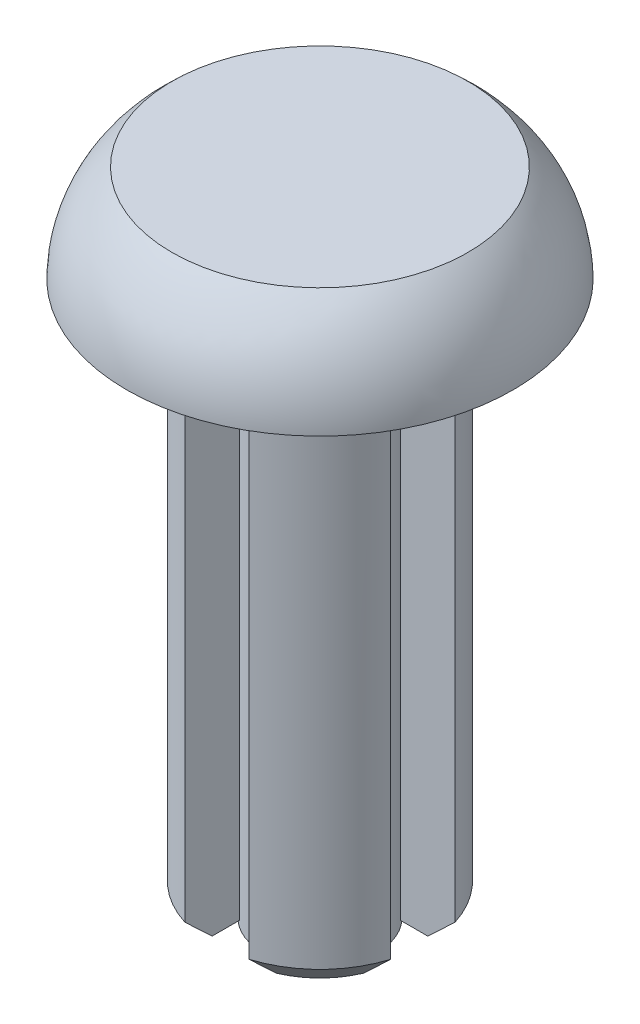
ISO-10303-21;
HEADER;
FILE_DESCRIPTION(('STEP AP214'),'2;1');
FILE_NAME('part.step','',(''),(''),'','','');
FILE_SCHEMA(('AUTOMOTIVE_DESIGN { 1 0 10303 214 1 1 1 1 }'));
ENDSEC;
DATA;
#1=APPLICATION_CONTEXT('core data for automotive mechanical design processes');
#2=APPLICATION_PROTOCOL_DEFINITION('international standard','automotive_design',2000,#1);
#3=PRODUCT_CONTEXT('',#1,'mechanical');
#4=PRODUCT('Part','Part','',(#3));
#5=PRODUCT_RELATED_PRODUCT_CATEGORY('part','',(#4));
#6=PRODUCT_DEFINITION_FORMATION('','',#4);
#7=PRODUCT_DEFINITION_CONTEXT('part definition',#1,'design');
#8=PRODUCT_DEFINITION('design','',#6,#7);
#9=PRODUCT_DEFINITION_SHAPE('','',#8);
#10=(LENGTH_UNIT() NAMED_UNIT(*) SI_UNIT(.MILLI.,.METRE.));
#11=(NAMED_UNIT(*) PLANE_ANGLE_UNIT() SI_UNIT($,.RADIAN.));
#12=(NAMED_UNIT(*) SI_UNIT($,.STERADIAN.) SOLID_ANGLE_UNIT());
#13=UNCERTAINTY_MEASURE_WITH_UNIT(LENGTH_MEASURE(1.E-05),#10,'distance_accuracy_value','');
#14=(GEOMETRIC_REPRESENTATION_CONTEXT(3) GLOBAL_UNCERTAINTY_ASSIGNED_CONTEXT((#13)) GLOBAL_UNIT_ASSIGNED_CONTEXT((#10,
#11,#12)) REPRESENTATION_CONTEXT('',''));
#15=CARTESIAN_POINT('',(0.,0.,0.));
#16=DIRECTION('',(0.,0.,1.));
#17=DIRECTION('',(1.,0.,0.));
#18=AXIS2_PLACEMENT_3D('',#15,#16,#17);
#19=CARTESIAN_POINT('',(0.,1.905,0.));
#20=DIRECTION('',(0.,1.,0.));
#21=DIRECTION('',(0.,0.,1.));
#22=AXIS2_PLACEMENT_3D('',#19,#20,#21);
#23=PLANE('',#22);
#24=CARTESIAN_POINT('',(0.,1.905,0.));
#25=DIRECTION('',(0.,1.,0.));
#26=DIRECTION('',(0.,0.,1.));
#27=AXIS2_PLACEMENT_3D('',#24,#25,#26);
#28=CIRCLE('',#27,2.921);
#29=CARTESIAN_POINT('',(0.,1.905,2.921));
#30=VERTEX_POINT('',#29);
#31=EDGE_CURVE('E20',#30,#30,#28,.F.);
#32=ORIENTED_EDGE('',*,*,#31,.F.);
#33=EDGE_LOOP('',(#32));
#34=FACE_BOUND('',#33,.T.);
#35=ADVANCED_FACE('F17',(#34),#23,.T.);
#36=CARTESIAN_POINT('',(0.,-11.4394,0.));
#37=DIRECTION('',(0.,-1.,0.));
#38=DIRECTION('',(0.,0.,-1.));
#39=AXIS2_PLACEMENT_3D('',#36,#37,#38);
#40=PLANE('',#39);
#41=CARTESIAN_POINT('',(0.,-11.4393999999152,0.));
#42=DIRECTION('',(0.,1.,0.));
#43=DIRECTION('',(0.,0.,1.));
#44=AXIS2_PLACEMENT_3D('',#41,#42,#43);
#45=CIRCLE('',#44,0.634999999988395);
#46=CARTESIAN_POINT('',(0.,-11.4393999999152,0.634999999988395));
#47=VERTEX_POINT('',#46);
#48=EDGE_CURVE('E164',#47,#47,#45,.T.);
#49=ORIENTED_EDGE('',*,*,#48,.F.);
#50=EDGE_LOOP('',(#49));
#51=FACE_BOUND('',#50,.T.);
#52=ADVANCED_FACE('F206',(#51),#40,.T.);
#53=CARTESIAN_POINT('',(0.,-0.0595861521909685,1.19674395959077));
#54=DIRECTION('',(1.,0.,0.));
#55=DIRECTION('',(0.,0.,1.));
#56=AXIS2_PLACEMENT_3D('',#53,#54,#55);
#57=CIRCLE('',#56,2.61393527889813);
#58=TRIMMED_CURVE('',#57,(PARAMETER_VALUE(-2.04635172054682)),
(PARAMETER_VALUE(2.04635172054682)),.T.,.PARAMETER.);
#59=CARTESIAN_POINT('',(0.,-0.0595861521909685,0.));
#60=DIRECTION('',(0.,1.,0.));
#61=AXIS1_PLACEMENT('',#59,#60);
#62=SURFACE_OF_REVOLUTION('',#58,#61);
#63=ORIENTED_EDGE('',*,*,#31,.T.);
#64=EDGE_LOOP('',(#63));
#65=FACE_BOUND('',#64,.T.);
#66=CARTESIAN_POINT('',(0.,0.,0.));
#67=DIRECTION('',(0.,1.,0.));
#68=DIRECTION('',(0.,0.,1.));
#69=AXIS2_PLACEMENT_3D('',#66,#67,#68);
#70=CIRCLE('',#69,3.80999999998721);
#71=CARTESIAN_POINT('',(0.,0.,3.80999999998721));
#72=VERTEX_POINT('',#71);
#73=EDGE_CURVE('E196',#72,#72,#70,.F.);
#74=ORIENTED_EDGE('',*,*,#73,.F.);
#75=EDGE_LOOP('',(#74));
#76=FACE_BOUND('',#75,.T.);
#77=ADVANCED_FACE('F202',(#65,#76),#62,.F.);
#78=CARTESIAN_POINT('',(0.,-10.8044,0.));
#79=DIRECTION('',(0.,-1.,0.));
#80=DIRECTION('',(0.,0.,-1.));
#81=AXIS2_PLACEMENT_3D('',#78,#79,#80);
#82=PLANE('',#81);
#83=DIRECTION('',(0.,0.,-1.));
#84=VECTOR('',#83,1.);
#85=CARTESIAN_POINT('',(0.635000000000001,-10.8044,2.03026292940102));
#86=LINE('',#85,#84);
#87=CARTESIAN_POINT('',(0.635000000000001,-10.8043999999918,1.48954542139407));
#88=VERTEX_POINT('',#87);
#89=CARTESIAN_POINT('',(0.635,-10.8044,0.950380976240581));
#90=VERTEX_POINT('',#89);
#91=EDGE_CURVE('E359',#88,#90,#86,.T.);
#92=ORIENTED_EDGE('',*,*,#91,.T.);
#93=CARTESIAN_POINT('',(0.,-10.8044,0.));
#94=DIRECTION('',(0.,1.,0.));
#95=DIRECTION('',(0.,0.,1.));
#96=AXIS2_PLACEMENT_3D('',#93,#94,#95);
#97=CIRCLE('',#96,1.143);
#98=CARTESIAN_POINT('',(0.950380976240581,-10.8044,0.635));
#99=VERTEX_POINT('',#98);
#100=EDGE_CURVE('E163',#99,#90,#97,.F.);
#101=ORIENTED_EDGE('',*,*,#100,.F.);
#102=DIRECTION('',(1.,0.,0.));
#103=VECTOR('',#102,1.);
#104=CARTESIAN_POINT('',(0.635,-10.8044,0.635));
#105=LINE('',#104,#103);
#106=CARTESIAN_POINT('',(1.48954542139407,-10.8043999999918,0.635));
#107=VERTEX_POINT('',#106);
#108=EDGE_CURVE('E190',#99,#107,#105,.T.);
#109=ORIENTED_EDGE('',*,*,#108,.T.);
#110=CARTESIAN_POINT('',(0.,-10.8043999999836,0.));
#111=DIRECTION('',(0.,1.,0.));
#112=DIRECTION('',(0.,0.,1.));
#113=AXIS2_PLACEMENT_3D('',#110,#111,#112);
#114=CIRCLE('',#113,1.61924999997609);
#115=EDGE_CURVE('E191',#88,#107,#114,.T.);
#116=ORIENTED_EDGE('',*,*,#115,.F.);
#117=EDGE_LOOP('',(#92,#101,#109,#116));
#118=FACE_BOUND('',#117,.T.);
#119=ADVANCED_FACE('F205',(#118),#82,.T.);
#120=CARTESIAN_POINT('',(0.,-10.8044,0.));
#121=DIRECTION('',(0.,-1.,0.));
#122=DIRECTION('',(0.,0.,-1.));
#123=AXIS2_PLACEMENT_3D('',#120,#121,#122);
#124=PLANE('',#123);
#125=DIRECTION('',(-1.,0.,0.));
#126=VECTOR('',#125,1.);
#127=CARTESIAN_POINT('',(0.635,-10.8044,-0.635));
#128=LINE('',#127,#126);
#129=CARTESIAN_POINT('',(1.48954542133228,-10.8043999999918,-0.635));
#130=VERTEX_POINT('',#129);
#131=CARTESIAN_POINT('',(0.950380976240581,-10.8044,-0.635));
#132=VERTEX_POINT('',#131);
#133=EDGE_CURVE('E167',#130,#132,#128,.T.);
#134=ORIENTED_EDGE('',*,*,#133,.T.);
#135=CARTESIAN_POINT('',(0.,-10.8044,0.));
#136=DIRECTION('',(0.,1.,0.));
#137=DIRECTION('',(0.,0.,1.));
#138=AXIS2_PLACEMENT_3D('',#135,#136,#137);
#139=CIRCLE('',#138,1.143);
#140=CARTESIAN_POINT('',(0.635,-10.8044,-0.950380976240581));
#141=VERTEX_POINT('',#140);
#142=EDGE_CURVE('E151',#141,#132,#139,.F.);
#143=ORIENTED_EDGE('',*,*,#142,.F.);
#144=DIRECTION('',(0.,0.,-1.));
#145=VECTOR('',#144,1.);
#146=CARTESIAN_POINT('',(0.635,-10.8044,-0.635));
#147=LINE('',#146,#145);
#148=CARTESIAN_POINT('',(0.635000000000001,-10.8043999999918,-1.48954542133228));
#149=VERTEX_POINT('',#148);
#150=EDGE_CURVE('E338',#141,#149,#147,.T.);
#151=ORIENTED_EDGE('',*,*,#150,.T.);
#152=CARTESIAN_POINT('',(0.,-10.8043999999836,0.));
#153=DIRECTION('',(0.,1.,0.));
#154=DIRECTION('',(0.,0.,1.));
#155=AXIS2_PLACEMENT_3D('',#152,#153,#154);
#156=CIRCLE('',#155,1.61924999991925);
#157=EDGE_CURVE('E170',#130,#149,#156,.T.);
#158=ORIENTED_EDGE('',*,*,#157,.F.);
#159=EDGE_LOOP('',(#134,#143,#151,#158));
#160=FACE_BOUND('',#159,.T.);
#161=ADVANCED_FACE('F168',(#160),#124,.T.);
#162=CARTESIAN_POINT('',(0.,-10.9313999999472,0.));
#163=DIRECTION('',(0.,1.,0.));
#164=DIRECTION('',(0.,0.,1.));
#165=AXIS2_PLACEMENT_3D('',#162,#163,#164);
#166=CONICAL_SURFACE('',#165,1.14299999995637,0.785398163397448);
#167=ORIENTED_EDGE('',*,*,#48,.T.);
#168=EDGE_LOOP('',(#167));
#169=FACE_BOUND('',#168,.T.);
#170=CARTESIAN_POINT('',(0.,-10.9314,0.));
#171=DIRECTION('',(0.,1.,0.));
#172=DIRECTION('',(0.,0.,1.));
#173=AXIS2_PLACEMENT_3D('',#170,#171,#172);
#174=CIRCLE('',#173,1.143);
#175=CARTESIAN_POINT('',(0.,-10.9314,1.143));
#176=VERTEX_POINT('',#175);
#177=EDGE_CURVE('E367',#176,#176,#174,.T.);
#178=ORIENTED_EDGE('',*,*,#177,.F.);
#179=EDGE_LOOP('',(#178));
#180=FACE_BOUND('',#179,.T.);
#181=ADVANCED_FACE('F434',(#169,#180),#166,.T.);
#182=CARTESIAN_POINT('',(0.,0.,0.));
#183=DIRECTION('',(0.,1.,0.));
#184=DIRECTION('',(0.,0.,1.));
#185=AXIS2_PLACEMENT_3D('',#182,#183,#184);
#186=CONICAL_SURFACE('',#185,3.80999999993037,1.54799877919605);
#187=ORIENTED_EDGE('',*,*,#73,.T.);
#188=EDGE_LOOP('',(#187));
#189=FACE_BOUND('',#188,.T.);
#190=CARTESIAN_POINT('',(0.,-0.0227955728942452,0.));
#191=DIRECTION('',(0.,1.,0.));
#192=DIRECTION('',(0.,0.,1.));
#193=AXIS2_PLACEMENT_3D('',#190,#191,#192);
#194=CIRCLE('',#193,2.81025985283353);
#195=CARTESIAN_POINT('',(0.,-0.0227955728942452,2.81025985283353));
#196=VERTEX_POINT('',#195);
#197=EDGE_CURVE('E325',#196,#196,#194,.T.);
#198=ORIENTED_EDGE('',*,*,#197,.T.);
#199=EDGE_LOOP('',(#198));
#200=FACE_BOUND('',#199,.T.);
#201=ADVANCED_FACE('F431',(#189,#200),#186,.T.);
#202=CARTESIAN_POINT('',(0.635000000000001,-0.644399999999998,2.03026292940102));
#203=DIRECTION('',(1.,0.,0.));
#204=DIRECTION('',(0.,0.,-1.));
#205=AXIS2_PLACEMENT_3D('',#202,#203,#204);
#206=PLANE('',#205);
#207=CARTESIAN_POINT('',(0.635000000000001,-10.2963999999739,2.03026292938615));
#208=CARTESIAN_POINT('',(0.635000000000001,-10.3390858324256,1.98553535088088));
#209=CARTESIAN_POINT('',(0.635000000000001,-10.3817085821733,1.94074736694082));
#210=CARTESIAN_POINT('',(0.635000000000001,-10.4667920637135,1.85101953980129));
#211=CARTESIAN_POINT('',(0.635000000000001,-10.5092527987847,1.80607969970996));
#212=CARTESIAN_POINT('',(0.635000000000001,-10.5939784631004,1.71601494909532));
#213=CARTESIAN_POINT('',(0.635000000000001,-10.6362433908405,1.67089003715512));
#214=CARTESIAN_POINT('',(0.635000000000001,-10.7205231739316,1.580405652873));
#215=CARTESIAN_POINT('',(0.635000000000001,-10.762538024149,1.53504617575149));
#216=CARTESIAN_POINT('',(0.635000000000001,-10.8043999999848,1.48954542140173));
#217=B_SPLINE_CURVE_WITH_KNOTS('',3,(#207,#208,#209,#210,#211,#212,#213,#214,#215,#216),
.UNSPECIFIED.,.F.,.F.,(4,2,2,2,4),(0.,0.185482565147711,0.370961356623039,0.556441570750558,
0.741925579300346),.UNSPECIFIED.);
#218=CARTESIAN_POINT('',(0.635000000000001,-10.296399999987,2.03026292939358));
#219=VERTEX_POINT('',#218);
#220=EDGE_CURVE('E362',#219,#88,#217,.T.);
#221=ORIENTED_EDGE('',*,*,#220,.F.);
#222=DIRECTION('',(0.,1.,0.));
#223=VECTOR('',#222,1.);
#224=CARTESIAN_POINT('',(0.635000000000001,-10.8044,2.03026292940102));
#225=LINE('',#224,#223);
#226=CARTESIAN_POINT('',(0.635000000000001,-0.644399999999998,2.03026292940102));
#227=VERTEX_POINT('',#226);
#228=EDGE_CURVE('E321',#227,#219,#225,.F.);
#229=ORIENTED_EDGE('',*,*,#228,.F.);
#230=DIRECTION('',(0.,0.,-1.));
#231=VECTOR('',#230,1.);
#232=CARTESIAN_POINT('',(0.635000000000001,-0.644399999999998,2.03026292940102));
#233=LINE('',#232,#231);
#234=CARTESIAN_POINT('',(0.635,-0.644399999999998,0.950380976240581));
#235=VERTEX_POINT('',#234);
#236=EDGE_CURVE('E195',#235,#227,#233,.F.);
#237=ORIENTED_EDGE('',*,*,#236,.F.);
#238=DIRECTION('',(0.,1.,0.));
#239=VECTOR('',#238,1.);
#240=CARTESIAN_POINT('',(0.635,-0.644399999999998,0.950380976240581));
#241=LINE('',#240,#239);
#242=EDGE_CURVE('E192',#90,#235,#241,.T.);
#243=ORIENTED_EDGE('',*,*,#242,.F.);
#244=ORIENTED_EDGE('',*,*,#91,.F.);
#245=EDGE_LOOP('',(#221,#229,#237,#243,#244));
#246=FACE_BOUND('',#245,.T.);
#247=ADVANCED_FACE('F414',(#246),#206,.F.);
#248=CARTESIAN_POINT('',(0.,-10.2963999999588,0.));
#249=DIRECTION('',(0.,1.,0.));
#250=DIRECTION('',(0.,0.,1.));
#251=AXIS2_PLACEMENT_3D('',#248,#249,#250);
#252=CONICAL_SURFACE('',#251,2.12725000000091,0.785398163397448);
#253=ORIENTED_EDGE('',*,*,#220,.T.);
#254=ORIENTED_EDGE('',*,*,#115,.T.);
#255=CARTESIAN_POINT('',(1.48954542140814,-10.8043999999789,0.635));
#256=CARTESIAN_POINT('',(1.53504617575691,-10.762538024144,0.635));
#257=CARTESIAN_POINT('',(1.58040565287744,-10.7205231739275,0.635));
#258=CARTESIAN_POINT('',(1.6708900371576,-10.6362433908382,0.635));
#259=CARTESIAN_POINT('',(1.71601494909682,-10.5939784630989,0.635));
#260=CARTESIAN_POINT('',(1.80607969970952,-10.5092527987851,0.635));
#261=CARTESIAN_POINT('',(1.85101953979988,-10.4667920637149,0.635));
#262=CARTESIAN_POINT('',(1.94074736693748,-10.3817085821765,0.635));
#263=CARTESIAN_POINT('',(1.98553535087658,-10.3390858324297,0.635));
#264=CARTESIAN_POINT('',(2.03026292938089,-10.2963999999789,0.635));
#265=B_SPLINE_CURVE_WITH_KNOTS('',3,(#255,#256,#257,#258,#259,#260,#261,#262,#263,#264),
.UNSPECIFIED.,.F.,.F.,(4,2,2,2,4),(0.,0.185484008545792,0.370964222669312,0.556443014140646,
0.74192557928436),.UNSPECIFIED.);
#266=CARTESIAN_POINT('',(2.03026292939095,-10.2963999999895,0.635));
#267=VERTEX_POINT('',#266);
#268=EDGE_CURVE('E352',#107,#267,#265,.T.);
#269=ORIENTED_EDGE('',*,*,#268,.T.);
#270=CARTESIAN_POINT('',(0.,-10.2964,0.));
#271=DIRECTION('',(0.,1.,0.));
#272=DIRECTION('',(0.,0.,1.));
#273=AXIS2_PLACEMENT_3D('',#270,#271,#272);
#274=CIRCLE('',#273,2.12725);
#275=EDGE_CURVE('E324',#219,#267,#274,.T.);
#276=ORIENTED_EDGE('',*,*,#275,.F.);
#277=EDGE_LOOP('',(#253,#254,#269,#276));
#278=FACE_BOUND('',#277,.T.);
#279=ADVANCED_FACE('F410',(#278),#252,.T.);
#280=CARTESIAN_POINT('',(0.635,-0.644399999999998,0.635));
#281=DIRECTION('',(0.,0.,1.));
#282=DIRECTION('',(1.,0.,0.));
#283=AXIS2_PLACEMENT_3D('',#280,#281,#282);
#284=PLANE('',#283);
#285=ORIENTED_EDGE('',*,*,#268,.F.);
#286=ORIENTED_EDGE('',*,*,#108,.F.);
#287=DIRECTION('',(0.,1.,0.));
#288=VECTOR('',#287,1.);
#289=CARTESIAN_POINT('',(0.950380976240581,-0.644399999999998,0.635));
#290=LINE('',#289,#288);
#291=CARTESIAN_POINT('',(0.950380976240581,-0.644399999999998,0.635));
#292=VERTEX_POINT('',#291);
#293=EDGE_CURVE('E187',#292,#99,#290,.F.);
#294=ORIENTED_EDGE('',*,*,#293,.F.);
#295=DIRECTION('',(1.,0.,0.));
#296=VECTOR('',#295,1.);
#297=CARTESIAN_POINT('',(0.,-0.644399999999998,0.635));
#298=LINE('',#297,#296);
#299=CARTESIAN_POINT('',(2.03026292940102,-0.644399999999998,0.635));
#300=VERTEX_POINT('',#299);
#301=EDGE_CURVE('E182',#300,#292,#298,.F.);
#302=ORIENTED_EDGE('',*,*,#301,.F.);
#303=DIRECTION('',(0.,1.,0.));
#304=VECTOR('',#303,1.);
#305=CARTESIAN_POINT('',(2.03026292940102,-10.8044,0.635));
#306=LINE('',#305,#304);
#307=EDGE_CURVE('E353',#267,#300,#306,.T.);
#308=ORIENTED_EDGE('',*,*,#307,.F.);
#309=EDGE_LOOP('',(#285,#286,#294,#302,#308));
#310=FACE_BOUND('',#309,.T.);
#311=ADVANCED_FACE('F408',(#310),#284,.F.);
#312=CARTESIAN_POINT('',(0.,-0.644399999999998,0.));
#313=DIRECTION('',(0.,-1.,0.));
#314=DIRECTION('',(0.,0.,-1.));
#315=AXIS2_PLACEMENT_3D('',#312,#313,#314);
#316=PLANE('',#315);
#317=DIRECTION('',(-1.,0.,0.));
#318=VECTOR('',#317,1.);
#319=CARTESIAN_POINT('',(0.635,-0.644399999999998,-0.635));
#320=LINE('',#319,#318);
#321=CARTESIAN_POINT('',(0.950380976240581,-0.644399999999998,-0.635));
#322=VERTEX_POINT('',#321);
#323=CARTESIAN_POINT('',(2.03026292940102,-0.644399999999998,-0.635));
#324=VERTEX_POINT('',#323);
#325=EDGE_CURVE('E174',#322,#324,#320,.F.);
#326=ORIENTED_EDGE('',*,*,#325,.T.);
#327=CARTESIAN_POINT('',(0.,-0.644399999999998,0.));
#328=DIRECTION('',(0.,1.,0.));
#329=DIRECTION('',(0.,0.,1.));
#330=AXIS2_PLACEMENT_3D('',#327,#328,#329);
#331=CIRCLE('',#330,2.12725);
#332=EDGE_CURVE('E348',#300,#324,#331,.T.);
#333=ORIENTED_EDGE('',*,*,#332,.F.);
#334=ORIENTED_EDGE('',*,*,#301,.T.);
#335=CARTESIAN_POINT('',(0.,-0.644399999999998,0.));
#336=DIRECTION('',(0.,1.,0.));
#337=DIRECTION('',(0.,0.,1.));
#338=AXIS2_PLACEMENT_3D('',#335,#336,#337);
#339=CIRCLE('',#338,1.143);
#340=EDGE_CURVE('E179',#292,#322,#339,.T.);
#341=ORIENTED_EDGE('',*,*,#340,.T.);
#342=EDGE_LOOP('',(#326,#333,#334,#341));
#343=FACE_BOUND('',#342,.T.);
#344=ADVANCED_FACE('F505',(#343),#316,.T.);
#345=CARTESIAN_POINT('',(0.635,-0.644399999999998,-0.635));
#346=DIRECTION('',(0.,0.,-1.));
#347=DIRECTION('',(-1.,0.,0.));
#348=AXIS2_PLACEMENT_3D('',#345,#346,#347);
#349=PLANE('',#348);
#350=CARTESIAN_POINT('',(2.03026292935776,-10.2963999999441,-0.635));
#351=CARTESIAN_POINT('',(1.98553535085204,-10.3390858323963,-0.635));
#352=CARTESIAN_POINT('',(1.94074736691151,-10.3817085821444,-0.635));
#353=CARTESIAN_POINT('',(1.85101953977105,-10.4667920636853,-0.635));
#354=CARTESIAN_POINT('',(1.80607969967926,-10.5092527987568,-0.635));
#355=CARTESIAN_POINT('',(1.71601494906366,-10.5939784630732,-0.635));
#356=CARTESIAN_POINT('',(1.67089003712298,-10.6362433908137,-0.635));
#357=CARTESIAN_POINT('',(1.58040565283988,-10.7205231739055,-0.635));
#358=CARTESIAN_POINT('',(1.53504617571787,-10.7625380241232,-0.635));
#359=CARTESIAN_POINT('',(1.4895454213676,-10.8043999999593,-0.635));
#360=B_SPLINE_CURVE_WITH_KNOTS('',3,(#350,#351,#352,#353,#354,#355,#356,#357,#358,#359),
.UNSPECIFIED.,.F.,.F.,(4,2,2,2,4),(0.,0.185482565149494,0.370961356626607,0.556441570755906,
0.741925579307479),.UNSPECIFIED.);
#361=CARTESIAN_POINT('',(2.03026292937939,-10.2963999999721,-0.635));
#362=VERTEX_POINT('',#361);
#363=EDGE_CURVE('E173',#362,#130,#360,.T.);
#364=ORIENTED_EDGE('',*,*,#363,.F.);
#365=DIRECTION('',(0.,1.,0.));
#366=VECTOR('',#365,1.);
#367=CARTESIAN_POINT('',(2.03026292940102,-10.8044,-0.635));
#368=LINE('',#367,#366);
#369=EDGE_CURVE('E343',#324,#362,#368,.F.);
#370=ORIENTED_EDGE('',*,*,#369,.F.);
#371=ORIENTED_EDGE('',*,*,#325,.F.);
#372=DIRECTION('',(0.,1.,0.));
#373=VECTOR('',#372,1.);
#374=CARTESIAN_POINT('',(0.950380976240581,-0.644399999999998,-0.635));
#375=LINE('',#374,#373);
#376=EDGE_CURVE('E156',#132,#322,#375,.T.);
#377=ORIENTED_EDGE('',*,*,#376,.F.);
#378=ORIENTED_EDGE('',*,*,#133,.F.);
#379=EDGE_LOOP('',(#364,#370,#371,#377,#378));
#380=FACE_BOUND('',#379,.T.);
#381=ADVANCED_FACE('F177',(#380),#349,.F.);
#382=CARTESIAN_POINT('',(0.,-10.2964000000156,0.));
#383=DIRECTION('',(0.,1.,0.));
#384=DIRECTION('',(0.,0.,1.));
#385=AXIS2_PLACEMENT_3D('',#382,#383,#384);
#386=CONICAL_SURFACE('',#385,2.12724999988723,0.785398163397448);
#387=ORIENTED_EDGE('',*,*,#363,.T.);
#388=ORIENTED_EDGE('',*,*,#157,.T.);
#389=CARTESIAN_POINT('',(0.635000000015535,-10.8043999999619,-1.48954542138207));
#390=CARTESIAN_POINT('',(0.63500000000561,-10.7625380241212,-1.53504617572625));
#391=CARTESIAN_POINT('',(0.635000000001511,-10.7205231739021,-1.58040565284516));
#392=CARTESIAN_POINT('',(0.63499999999849,-10.6362433908105,-1.67089003712473));
#393=CARTESIAN_POINT('',(0.634999999999569,-10.5939784630715,-1.71601494906497));
#394=CARTESIAN_POINT('',(0.635000000000432,-10.5092527987574,-1.80607969967905));
#395=CARTESIAN_POINT('',(0.635000000000217,-10.4667920636867,-1.85101953976977));
#396=CARTESIAN_POINT('',(0.634999999999785,-10.3817085821474,-1.94074736690808));
#397=CARTESIAN_POINT('',(0.634999999999569,-10.3390858324001,-1.98553535084752));
#398=CARTESIAN_POINT('',(0.635000000000001,-10.2963999999492,-2.0302629293525));
#399=B_SPLINE_CURVE_WITH_KNOTS('',3,(#389,#390,#391,#392,#393,#394,#395,#396,#397,#398),
.UNSPECIFIED.,.F.,.F.,(4,2,2,2,4),(0.,0.185484008547495,0.370964222672752,0.556443014145866,
0.741925579291334),.UNSPECIFIED.);
#400=CARTESIAN_POINT('',(0.635000000000001,-10.2963999999746,-2.03026292937676));
#401=VERTEX_POINT('',#400);
#402=EDGE_CURVE('E340',#149,#401,#399,.T.);
#403=ORIENTED_EDGE('',*,*,#402,.T.);
#404=CARTESIAN_POINT('',(0.,-10.2964,0.));
#405=DIRECTION('',(0.,1.,0.));
#406=DIRECTION('',(0.,0.,1.));
#407=AXIS2_PLACEMENT_3D('',#404,#405,#406);
#408=CIRCLE('',#407,2.12725);
#409=EDGE_CURVE('E337',#362,#401,#408,.T.);
#410=ORIENTED_EDGE('',*,*,#409,.F.);
#411=EDGE_LOOP('',(#387,#388,#403,#410));
#412=FACE_BOUND('',#411,.T.);
#413=ADVANCED_FACE('F390',(#412),#386,.T.);
#414=CARTESIAN_POINT('',(0.635,-0.644399999999998,-0.635));
#415=DIRECTION('',(1.,0.,0.));
#416=DIRECTION('',(0.,0.,-1.));
#417=AXIS2_PLACEMENT_3D('',#414,#415,#416);
#418=PLANE('',#417);
#419=ORIENTED_EDGE('',*,*,#402,.F.);
#420=ORIENTED_EDGE('',*,*,#150,.F.);
#421=DIRECTION('',(0.,1.,0.));
#422=VECTOR('',#421,1.);
#423=CARTESIAN_POINT('',(0.635,-0.644399999999998,-0.950380976240581));
#424=LINE('',#423,#422);
#425=CARTESIAN_POINT('',(0.635,-0.644399999999998,-0.950380976240581));
#426=VERTEX_POINT('',#425);
#427=EDGE_CURVE('E160',#426,#141,#424,.F.);
#428=ORIENTED_EDGE('',*,*,#427,.F.);
#429=DIRECTION('',(0.,0.,-1.));
#430=VECTOR('',#429,1.);
#431=CARTESIAN_POINT('',(0.635,-0.644399999999998,-0.635));
#432=LINE('',#431,#430);
#433=CARTESIAN_POINT('',(0.635000000000001,-0.644399999999998,-2.03026292940102));
#434=VERTEX_POINT('',#433);
#435=EDGE_CURVE('E344',#434,#426,#432,.F.);
#436=ORIENTED_EDGE('',*,*,#435,.F.);
#437=DIRECTION('',(0.,1.,0.));
#438=VECTOR('',#437,1.);
#439=CARTESIAN_POINT('',(0.635000000000002,-10.8044,-2.03026292940102));
#440=LINE('',#439,#438);
#441=EDGE_CURVE('E334',#401,#434,#440,.T.);
#442=ORIENTED_EDGE('',*,*,#441,.F.);
#443=EDGE_LOOP('',(#419,#420,#428,#436,#442));
#444=FACE_BOUND('',#443,.T.);
#445=ADVANCED_FACE('F387',(#444),#418,.F.);
#446=CARTESIAN_POINT('',(0.,-10.8044,0.));
#447=DIRECTION('',(0.,-1.,0.));
#448=DIRECTION('',(0.,0.,-1.));
#449=AXIS2_PLACEMENT_3D('',#446,#447,#448);
#450=PLANE('',#449);
#451=DIRECTION('',(0.,0.,1.));
#452=VECTOR('',#451,1.);
#453=CARTESIAN_POINT('',(-0.635,-10.8044,-0.635));
#454=LINE('',#453,#452);
#455=CARTESIAN_POINT('',(-0.635,-10.8043999999634,-1.48954542136318));
#456=VERTEX_POINT('',#455);
#457=CARTESIAN_POINT('',(-0.635,-10.8044,-0.950380976240581));
#458=VERTEX_POINT('',#457);
#459=EDGE_CURVE('E297',#456,#458,#454,.T.);
#460=ORIENTED_EDGE('',*,*,#459,.T.);
#461=CARTESIAN_POINT('',(0.,-10.8044,0.));
#462=DIRECTION('',(0.,1.,0.));
#463=DIRECTION('',(0.,0.,1.));
#464=AXIS2_PLACEMENT_3D('',#461,#462,#463);
#465=CIRCLE('',#464,1.143);
#466=CARTESIAN_POINT('',(-0.950380976240581,-10.8044,-0.635));
#467=VERTEX_POINT('',#466);
#468=EDGE_CURVE('E372',#467,#458,#465,.F.);
#469=ORIENTED_EDGE('',*,*,#468,.F.);
#470=DIRECTION('',(-1.,0.,0.));
#471=VECTOR('',#470,1.);
#472=CARTESIAN_POINT('',(-2.03026292940102,-10.8044,-0.635));
#473=LINE('',#472,#471);
#474=CARTESIAN_POINT('',(-1.48954542136318,-10.8043999999634,-0.635));
#475=VERTEX_POINT('',#474);
#476=EDGE_CURVE('E286',#467,#475,#473,.T.);
#477=ORIENTED_EDGE('',*,*,#476,.T.);
#478=CARTESIAN_POINT('',(0.,-10.8043999999268,0.));
#479=DIRECTION('',(0.,1.,0.));
#480=DIRECTION('',(0.,0.,1.));
#481=AXIS2_PLACEMENT_3D('',#478,#479,#480);
#482=CIRCLE('',#481,1.61924999997609);
#483=EDGE_CURVE('E287',#456,#475,#482,.T.);
#484=ORIENTED_EDGE('',*,*,#483,.F.);
#485=EDGE_LOOP('',(#460,#469,#477,#484));
#486=FACE_BOUND('',#485,.T.);
#487=ADVANCED_FACE('F479',(#486),#450,.T.);
#488=CARTESIAN_POINT('',(0.,-11.4394,0.));
#489=DIRECTION('',(0.,1.,0.));
#490=DIRECTION('',(0.,0.,1.));
#491=AXIS2_PLACEMENT_3D('',#488,#489,#490);
#492=CYLINDRICAL_SURFACE('',#491,1.143);
#493=ORIENTED_EDGE('',*,*,#177,.T.);
#494=EDGE_LOOP('',(#493));
#495=FACE_BOUND('',#494,.T.);
#496=DIRECTION('',(0.,1.,0.));
#497=VECTOR('',#496,1.);
#498=CARTESIAN_POINT('',(-0.635,-0.644399999999998,-0.950380976240581));
#499=LINE('',#498,#497);
#500=CARTESIAN_POINT('',(-0.635,-0.644399999999998,-0.950380976240581));
#501=VERTEX_POINT('',#500);
#502=EDGE_CURVE('E332',#458,#501,#499,.T.);
#503=ORIENTED_EDGE('',*,*,#502,.T.);
#504=CARTESIAN_POINT('',(0.,-0.644399999999998,0.));
#505=DIRECTION('',(0.,1.,0.));
#506=DIRECTION('',(0.,0.,1.));
#507=AXIS2_PLACEMENT_3D('',#504,#505,#506);
#508=CIRCLE('',#507,1.143);
#509=EDGE_CURVE('E298',#426,#501,#508,.T.);
#510=ORIENTED_EDGE('',*,*,#509,.F.);
#511=ORIENTED_EDGE('',*,*,#427,.T.);
#512=ORIENTED_EDGE('',*,*,#142,.T.);
#513=ORIENTED_EDGE('',*,*,#376,.T.);
#514=ORIENTED_EDGE('',*,*,#340,.F.);
#515=ORIENTED_EDGE('',*,*,#293,.T.);
#516=ORIENTED_EDGE('',*,*,#100,.T.);
#517=ORIENTED_EDGE('',*,*,#242,.T.);
#518=CARTESIAN_POINT('',(0.,-0.644399999999998,0.));
#519=DIRECTION('',(0.,1.,0.));
#520=DIRECTION('',(0.,0.,1.));
#521=AXIS2_PLACEMENT_3D('',#518,#519,#520);
#522=CIRCLE('',#521,1.143);
#523=CARTESIAN_POINT('',(-0.635,-0.644399999999998,0.950380976240581));
#524=VERTEX_POINT('',#523);
#525=EDGE_CURVE('E369',#235,#524,#522,.F.);
#526=ORIENTED_EDGE('',*,*,#525,.T.);
#527=DIRECTION('',(0.,1.,0.));
#528=VECTOR('',#527,1.);
#529=CARTESIAN_POINT('',(-0.635,-0.644399999999998,0.950380976240581));
#530=LINE('',#529,#528);
#531=CARTESIAN_POINT('',(-0.635,-10.8044,0.950380976240581));
#532=VERTEX_POINT('',#531);
#533=EDGE_CURVE('E253',#524,#532,#530,.F.);
#534=ORIENTED_EDGE('',*,*,#533,.T.);
#535=CARTESIAN_POINT('',(0.,-10.8044,0.));
#536=DIRECTION('',(0.,1.,0.));
#537=DIRECTION('',(0.,0.,1.));
#538=AXIS2_PLACEMENT_3D('',#535,#536,#537);
#539=CIRCLE('',#538,1.143);
#540=CARTESIAN_POINT('',(-0.950380976240581,-10.8044,0.635));
#541=VERTEX_POINT('',#540);
#542=EDGE_CURVE('E366',#541,#532,#539,.T.);
#543=ORIENTED_EDGE('',*,*,#542,.F.);
#544=DIRECTION('',(0.,1.,0.));
#545=VECTOR('',#544,1.);
#546=CARTESIAN_POINT('',(-0.950380976240581,-0.644399999999998,0.635));
#547=LINE('',#546,#545);
#548=CARTESIAN_POINT('',(-0.950380976240581,-0.644399999999998,0.635));
#549=VERTEX_POINT('',#548);
#550=EDGE_CURVE('E327',#541,#549,#547,.T.);
#551=ORIENTED_EDGE('',*,*,#550,.T.);
#552=CARTESIAN_POINT('',(0.,-0.644399999999998,0.));
#553=DIRECTION('',(0.,1.,0.));
#554=DIRECTION('',(0.,0.,1.));
#555=AXIS2_PLACEMENT_3D('',#552,#553,#554);
#556=CIRCLE('',#555,1.143);
#557=CARTESIAN_POINT('',(-0.950380976240581,-0.644399999999998,-0.635));
#558=VERTEX_POINT('',#557);
#559=EDGE_CURVE('E261',#558,#549,#556,.T.);
#560=ORIENTED_EDGE('',*,*,#559,.F.);
#561=DIRECTION('',(0.,1.,0.));
#562=VECTOR('',#561,1.);
#563=CARTESIAN_POINT('',(-0.950380976240581,-0.644399999999998,-0.635));
#564=LINE('',#563,#562);
#565=EDGE_CURVE('E290',#558,#467,#564,.F.);
#566=ORIENTED_EDGE('',*,*,#565,.T.);
#567=ORIENTED_EDGE('',*,*,#468,.T.);
#568=EDGE_LOOP('',(#503,#510,#511,#512,#513,#514,#515,#516,#517,#526,#534,#543,#551,#560,#566,#567));
#569=FACE_BOUND('',#568,.T.);
#570=ADVANCED_FACE('F153',(#495,#569),#492,.T.);
#571=CARTESIAN_POINT('',(0.,-10.8044,0.));
#572=DIRECTION('',(0.,-1.,0.));
#573=DIRECTION('',(0.,0.,-1.));
#574=AXIS2_PLACEMENT_3D('',#571,#572,#573);
#575=PLANE('',#574);
#576=DIRECTION('',(1.,0.,0.));
#577=VECTOR('',#576,1.);
#578=CARTESIAN_POINT('',(-2.03026292940102,-10.8044,0.635));
#579=LINE('',#578,#577);
#580=CARTESIAN_POINT('',(-1.48954542145587,-10.8043999999918,0.635));
#581=VERTEX_POINT('',#580);
#582=EDGE_CURVE('E260',#581,#541,#579,.T.);
#583=ORIENTED_EDGE('',*,*,#582,.T.);
#584=ORIENTED_EDGE('',*,*,#542,.T.);
#585=DIRECTION('',(0.,0.,1.));
#586=VECTOR('',#585,1.);
#587=CARTESIAN_POINT('',(-0.634999999999999,-10.8044,2.03026292940102));
#588=LINE('',#587,#586);
#589=CARTESIAN_POINT('',(-0.635,-10.8043999999918,1.48954542145586));
#590=VERTEX_POINT('',#589);
#591=EDGE_CURVE('E247',#532,#590,#588,.T.);
#592=ORIENTED_EDGE('',*,*,#591,.T.);
#593=CARTESIAN_POINT('',(0.,-10.8043999999836,0.));
#594=DIRECTION('',(0.,1.,0.));
#595=DIRECTION('',(0.,0.,1.));
#596=AXIS2_PLACEMENT_3D('',#593,#594,#595);
#597=CIRCLE('',#596,1.61925000003293);
#598=EDGE_CURVE('E250',#581,#590,#597,.T.);
#599=ORIENTED_EDGE('',*,*,#598,.F.);
#600=EDGE_LOOP('',(#583,#584,#592,#599));
#601=FACE_BOUND('',#600,.T.);
#602=ADVANCED_FACE('F313',(#601),#575,.T.);
#603=CARTESIAN_POINT('',(0.,-0.0595861521909685,1.19674395959077));
#604=DIRECTION('',(1.,0.,0.));
#605=DIRECTION('',(0.,0.,1.));
#606=AXIS2_PLACEMENT_3D('',#603,#604,#605);
#607=CIRCLE('',#606,1.61393527889813);
#608=TRIMMED_CURVE('',#607,(PARAMETER_VALUE(-2.40610967080242)),
(PARAMETER_VALUE(2.40610967080242)),.T.,.PARAMETER.);
#609=CARTESIAN_POINT('',(0.,-0.0595861521909685,0.));
#610=DIRECTION('',(0.,1.,0.));
#611=AXIS1_PLACEMENT('',#609,#610);
#612=SURFACE_OF_REVOLUTION('',#608,#611);
#613=ORIENTED_EDGE('',*,*,#197,.F.);
#614=EDGE_LOOP('',(#613));
#615=FACE_BOUND('',#614,.T.);
#616=CARTESIAN_POINT('',(0.,0.905000000000001,0.));
#617=DIRECTION('',(0.,1.,0.));
#618=DIRECTION('',(0.,0.,1.));
#619=AXIS2_PLACEMENT_3D('',#616,#617,#618);
#620=CIRCLE('',#619,2.49071484004883);
#621=CARTESIAN_POINT('',(0.,0.905000000000001,2.49071484004883));
#622=VERTEX_POINT('',#621);
#623=EDGE_CURVE('E248',#622,#622,#620,.T.);
#624=ORIENTED_EDGE('',*,*,#623,.T.);
#625=EDGE_LOOP('',(#624));
#626=FACE_BOUND('',#625,.T.);
#627=ADVANCED_FACE('F308',(#615,#626),#612,.T.);
#628=CARTESIAN_POINT('',(0.,-0.644399999999998,0.));
#629=DIRECTION('',(0.,-1.,0.));
#630=DIRECTION('',(0.,0.,-1.));
#631=AXIS2_PLACEMENT_3D('',#628,#629,#630);
#632=PLANE('',#631);
#633=CARTESIAN_POINT('',(0.,-0.644399999999998,0.));
#634=DIRECTION('',(0.,1.,0.));
#635=DIRECTION('',(0.,0.,1.));
#636=AXIS2_PLACEMENT_3D('',#633,#634,#635);
#637=CIRCLE('',#636,2.12725);
#638=CARTESIAN_POINT('',(-0.634999999999999,-0.644399999999998,-2.03026292940102));
#639=VERTEX_POINT('',#638);
#640=EDGE_CURVE('E440',#434,#639,#637,.T.);
#641=ORIENTED_EDGE('',*,*,#640,.F.);
#642=ORIENTED_EDGE('',*,*,#435,.T.);
#643=ORIENTED_EDGE('',*,*,#509,.T.);
#644=DIRECTION('',(0.,0.,1.));
#645=VECTOR('',#644,1.);
#646=CARTESIAN_POINT('',(-0.635,-0.644399999999998,-0.635));
#647=LINE('',#646,#645);
#648=EDGE_CURVE('E319',#501,#639,#647,.F.);
#649=ORIENTED_EDGE('',*,*,#648,.T.);
#650=EDGE_LOOP('',(#641,#642,#643,#649));
#651=FACE_BOUND('',#650,.T.);
#652=ADVANCED_FACE('F304',(#651),#632,.T.);
#653=CARTESIAN_POINT('',(-0.635,-0.644399999999998,-0.635));
#654=DIRECTION('',(-1.,0.,0.));
#655=DIRECTION('',(0.,0.,1.));
#656=AXIS2_PLACEMENT_3D('',#653,#654,#655);
#657=PLANE('',#656);
#658=CARTESIAN_POINT('',(-0.634999999999999,-10.2963999999509,-2.03026292935066));
#659=CARTESIAN_POINT('',(-0.634999999999999,-10.3390858324007,-1.98553535084739));
#660=CARTESIAN_POINT('',(-0.634999999999999,-10.3817085821464,-1.94074736690933));
#661=CARTESIAN_POINT('',(-0.634999999999999,-10.4667920636827,-1.8510195397738));
#662=CARTESIAN_POINT('',(-0.634999999999999,-10.5092527987519,-1.80607969968448));
#663=CARTESIAN_POINT('',(-0.634999999999999,-10.5939784630636,-1.71601494907386));
#664=CARTESIAN_POINT('',(-0.635,-10.6362433908019,-1.67089003713568));
#665=CARTESIAN_POINT('',(-0.635,-10.720523173889,-1.5804056528576));
#666=CARTESIAN_POINT('',(-0.635,-10.7625380241045,-1.53504617573812));
#667=CARTESIAN_POINT('',(-0.635,-10.8043999999383,-1.4895454213904));
#668=B_SPLINE_CURVE_WITH_KNOTS('',3,(#658,#659,#660,#661,#662,#663,#664,#665,#666,#667),
.UNSPECIFIED.,.F.,.F.,(4,2,2,2,4),(0.,0.185482565139296,0.370961356606208,0.55644157072531,
0.741925579266682),.UNSPECIFIED.);
#669=CARTESIAN_POINT('',(-0.634999999999999,-10.2963999999755,-2.03026292937584));
#670=VERTEX_POINT('',#669);
#671=EDGE_CURVE('E291',#670,#456,#668,.T.);
#672=ORIENTED_EDGE('',*,*,#671,.F.);
#673=DIRECTION('',(0.,1.,0.));
#674=VECTOR('',#673,1.);
#675=CARTESIAN_POINT('',(-0.634999999999999,-10.8044,-2.03026292940102));
#676=LINE('',#675,#674);
#677=EDGE_CURVE('E442',#639,#670,#676,.F.);
#678=ORIENTED_EDGE('',*,*,#677,.F.);
#679=ORIENTED_EDGE('',*,*,#648,.F.);
#680=ORIENTED_EDGE('',*,*,#502,.F.);
#681=ORIENTED_EDGE('',*,*,#459,.F.);
#682=EDGE_LOOP('',(#672,#678,#679,#680,#681));
#683=FACE_BOUND('',#682,.T.);
#684=ADVANCED_FACE('F300',(#683),#657,.F.);
#685=CARTESIAN_POINT('',(0.,-10.2964000000725,0.));
#686=DIRECTION('',(0.,1.,0.));
#687=DIRECTION('',(0.,0.,1.));
#688=AXIS2_PLACEMENT_3D('',#685,#686,#687);
#689=CONICAL_SURFACE('',#688,2.12724999983038,0.785398163397448);
#690=ORIENTED_EDGE('',*,*,#671,.T.);
#691=ORIENTED_EDGE('',*,*,#483,.T.);
#692=CARTESIAN_POINT('',(-1.48954542138549,-10.8043999999429,-0.635));
#693=CARTESIAN_POINT('',(-1.53504617573378,-10.7625380241085,-0.635));
#694=CARTESIAN_POINT('',(-1.58040565285384,-10.7205231738925,-0.635));
#695=CARTESIAN_POINT('',(-1.67089003713305,-10.6362433908043,-0.635));
#696=CARTESIAN_POINT('',(-1.71601494907179,-10.5939784630656,-0.635));
#697=CARTESIAN_POINT('',(-1.80607969968353,-10.5092527987528,-0.635));
#698=CARTESIAN_POINT('',(-1.85101953977342,-10.4667920636831,-0.635));
#699=CARTESIAN_POINT('',(-1.94074736691005,-10.3817085821457,-0.635));
#700=CARTESIAN_POINT('',(-1.98553535084867,-10.3390858323995,-0.635));
#701=CARTESIAN_POINT('',(-2.0302629293525,-10.2963999999492,-0.635));
#702=B_SPLINE_CURVE_WITH_KNOTS('',3,(#692,#693,#694,#695,#696,#697,#698,#699,#700,#701),
.UNSPECIFIED.,.F.,.F.,(4,2,2,2,4),(0.,0.185484008543677,0.37096422266508,0.556443014134299,
0.741925579275895),.UNSPECIFIED.);
#703=CARTESIAN_POINT('',(-2.03026292937676,-10.2963999999746,-0.635));
#704=VERTEX_POINT('',#703);
#705=EDGE_CURVE('E280',#475,#704,#702,.T.);
#706=ORIENTED_EDGE('',*,*,#705,.T.);
#707=CARTESIAN_POINT('',(0.,-10.2964,0.));
#708=DIRECTION('',(0.,1.,0.));
#709=DIRECTION('',(0.,0.,1.));
#710=AXIS2_PLACEMENT_3D('',#707,#708,#709);
#711=CIRCLE('',#710,2.12725);
#712=EDGE_CURVE('E464',#670,#704,#711,.T.);
#713=ORIENTED_EDGE('',*,*,#712,.F.);
#714=EDGE_LOOP('',(#690,#691,#706,#713));
#715=FACE_BOUND('',#714,.T.);
#716=ADVANCED_FACE('F276',(#715),#689,.T.);
#717=CARTESIAN_POINT('',(-2.03026292940102,-0.644399999999998,-0.635));
#718=DIRECTION('',(0.,0.,-1.));
#719=DIRECTION('',(-1.,0.,0.));
#720=AXIS2_PLACEMENT_3D('',#717,#718,#719);
#721=PLANE('',#720);
#722=ORIENTED_EDGE('',*,*,#705,.F.);
#723=ORIENTED_EDGE('',*,*,#476,.F.);
#724=ORIENTED_EDGE('',*,*,#565,.F.);
#725=DIRECTION('',(1.,0.,0.));
#726=VECTOR('',#725,1.);
#727=CARTESIAN_POINT('',(0.,-0.644399999999998,-0.634999999999999));
#728=LINE('',#727,#726);
#729=CARTESIAN_POINT('',(-2.03026292940102,-0.644399999999998,-0.635));
#730=VERTEX_POINT('',#729);
#731=EDGE_CURVE('E285',#730,#558,#728,.T.);
#732=ORIENTED_EDGE('',*,*,#731,.F.);
#733=DIRECTION('',(0.,1.,0.));
#734=VECTOR('',#733,1.);
#735=CARTESIAN_POINT('',(-2.03026292940102,-10.8044,-0.635));
#736=LINE('',#735,#734);
#737=EDGE_CURVE('E461',#704,#730,#736,.T.);
#738=ORIENTED_EDGE('',*,*,#737,.F.);
#739=EDGE_LOOP('',(#722,#723,#724,#732,#738));
#740=FACE_BOUND('',#739,.T.);
#741=ADVANCED_FACE('F271',(#740),#721,.F.);
#742=CARTESIAN_POINT('',(0.,-0.644399999999998,0.));
#743=DIRECTION('',(0.,-1.,0.));
#744=DIRECTION('',(0.,0.,-1.));
#745=AXIS2_PLACEMENT_3D('',#742,#743,#744);
#746=PLANE('',#745);
#747=DIRECTION('',(1.,0.,0.));
#748=VECTOR('',#747,1.);
#749=CARTESIAN_POINT('',(-2.03026292940102,-0.644399999999998,0.635));
#750=LINE('',#749,#748);
#751=CARTESIAN_POINT('',(-2.03026292940102,-0.644399999999998,0.635));
#752=VERTEX_POINT('',#751);
#753=EDGE_CURVE('E329',#549,#752,#750,.F.);
#754=ORIENTED_EDGE('',*,*,#753,.T.);
#755=CARTESIAN_POINT('',(0.,-0.644399999999998,0.));
#756=DIRECTION('',(0.,1.,0.));
#757=DIRECTION('',(0.,0.,1.));
#758=AXIS2_PLACEMENT_3D('',#755,#756,#757);
#759=CIRCLE('',#758,2.12725);
#760=EDGE_CURVE('E455',#730,#752,#759,.T.);
#761=ORIENTED_EDGE('',*,*,#760,.F.);
#762=ORIENTED_EDGE('',*,*,#731,.T.);
#763=ORIENTED_EDGE('',*,*,#559,.T.);
#764=EDGE_LOOP('',(#754,#761,#762,#763));
#765=FACE_BOUND('',#764,.T.);
#766=ADVANCED_FACE('F267',(#765),#746,.T.);
#767=CARTESIAN_POINT('',(-2.03026292940102,-0.644399999999998,0.635));
#768=DIRECTION('',(0.,0.,1.));
#769=DIRECTION('',(1.,0.,0.));
#770=AXIS2_PLACEMENT_3D('',#767,#768,#769);
#771=PLANE('',#770);
#772=CARTESIAN_POINT('',(-2.03026292940744,-10.2964000000104,0.635));
#773=CARTESIAN_POINT('',(-1.98553535090413,-10.3390858324603,0.635));
#774=CARTESIAN_POINT('',(-1.94074736696604,-10.3817085822062,0.635));
#775=CARTESIAN_POINT('',(-1.85101953983045,-10.4667920637428,0.635));
#776=CARTESIAN_POINT('',(-1.80607969974111,-10.5092527988121,0.635));
#777=CARTESIAN_POINT('',(-1.71601494913046,-10.5939784631242,0.635));
#778=CARTESIAN_POINT('',(-1.67089003719227,-10.6362433908626,0.635));
#779=CARTESIAN_POINT('',(-1.58040565291421,-10.7205231739502,0.635));
#780=CARTESIAN_POINT('',(-1.53504617579474,-10.7625380241659,0.635));
#781=CARTESIAN_POINT('',(-1.48954542144705,-10.8043999999999,0.635));
#782=B_SPLINE_CURVE_WITH_KNOTS('',3,(#772,#773,#774,#775,#776,#777,#778,#779,#780,#781),
.UNSPECIFIED.,.F.,.F.,(4,2,2,2,4),(0.,0.185482565139676,0.370961356606971,0.556441570726454,
0.741925579268205),.UNSPECIFIED.);
#783=CARTESIAN_POINT('',(-2.03026292940423,-10.2964000000052,0.635));
#784=VERTEX_POINT('',#783);
#785=EDGE_CURVE('E254',#784,#581,#782,.T.);
#786=ORIENTED_EDGE('',*,*,#785,.F.);
#787=DIRECTION('',(0.,1.,0.));
#788=VECTOR('',#787,1.);
#789=CARTESIAN_POINT('',(-2.03026292940102,-10.8044,0.634999999999999));
#790=LINE('',#789,#788);
#791=EDGE_CURVE('E452',#752,#784,#790,.F.);
#792=ORIENTED_EDGE('',*,*,#791,.F.);
#793=ORIENTED_EDGE('',*,*,#753,.F.);
#794=ORIENTED_EDGE('',*,*,#550,.F.);
#795=ORIENTED_EDGE('',*,*,#582,.F.);
#796=EDGE_LOOP('',(#786,#792,#793,#794,#795));
#797=FACE_BOUND('',#796,.T.);
#798=ADVANCED_FACE('F263',(#797),#771,.F.);
#799=CARTESIAN_POINT('',(0.,-10.2964000000725,0.));
#800=DIRECTION('',(0.,1.,0.));
#801=DIRECTION('',(0.,0.,1.));
#802=AXIS2_PLACEMENT_3D('',#799,#800,#801);
#803=CONICAL_SURFACE('',#802,2.12724999994407,0.785398163397448);
#804=ORIENTED_EDGE('',*,*,#785,.T.);
#805=ORIENTED_EDGE('',*,*,#598,.T.);
#806=CARTESIAN_POINT('',(-0.635,-10.8044000000044,1.48954542144213));
#807=CARTESIAN_POINT('',(-0.635,-10.7625380241699,1.5350461757904));
#808=CARTESIAN_POINT('',(-0.635,-10.7205231739537,1.58040565291044));
#809=CARTESIAN_POINT('',(-0.635,-10.6362433908651,1.67089003718964));
#810=CARTESIAN_POINT('',(-0.634999999999999,-10.5939784631262,1.71601494912839));
#811=CARTESIAN_POINT('',(-0.634999999999999,-10.509252798813,1.80607969974017));
#812=CARTESIAN_POINT('',(-0.634999999999999,-10.4667920637432,1.85101953983007));
#813=CARTESIAN_POINT('',(-0.634999999999999,-10.3817085822055,1.94074736696676));
#814=CARTESIAN_POINT('',(-0.634999999999999,-10.3390858324591,1.98553535090542));
#815=CARTESIAN_POINT('',(-0.634999999999999,-10.2964000000087,2.03026292940928));
#816=B_SPLINE_CURVE_WITH_KNOTS('',3,(#806,#807,#808,#809,#810,#811,#812,#813,#814,#815),
.UNSPECIFIED.,.F.,.F.,(4,2,2,2,4),(0.,0.185484008544056,0.370964222665844,0.556443014135443,
0.741925579277422),.UNSPECIFIED.);
#817=CARTESIAN_POINT('',(-0.635,-10.2964000000043,2.03026292940515));
#818=VERTEX_POINT('',#817);
#819=EDGE_CURVE('E241',#590,#818,#816,.T.);
#820=ORIENTED_EDGE('',*,*,#819,.T.);
#821=CARTESIAN_POINT('',(0.,-10.2964,0.));
#822=DIRECTION('',(0.,1.,0.));
#823=DIRECTION('',(0.,0.,1.));
#824=AXIS2_PLACEMENT_3D('',#821,#822,#823);
#825=CIRCLE('',#824,2.12725);
#826=EDGE_CURVE('E448',#784,#818,#825,.T.);
#827=ORIENTED_EDGE('',*,*,#826,.F.);
#828=EDGE_LOOP('',(#804,#805,#820,#827));
#829=FACE_BOUND('',#828,.T.);
#830=ADVANCED_FACE('F237',(#829),#803,.T.);
#831=CARTESIAN_POINT('',(-0.634999999999999,-0.644399999999998,2.03026292940102));
#832=DIRECTION('',(-1.,0.,0.));
#833=DIRECTION('',(0.,0.,1.));
#834=AXIS2_PLACEMENT_3D('',#831,#832,#833);
#835=PLANE('',#834);
#836=ORIENTED_EDGE('',*,*,#819,.F.);
#837=ORIENTED_EDGE('',*,*,#591,.F.);
#838=ORIENTED_EDGE('',*,*,#533,.F.);
#839=DIRECTION('',(0.,0.,-1.));
#840=VECTOR('',#839,1.);
#841=CARTESIAN_POINT('',(-0.634999999999999,-0.644399999999998,0.));
#842=LINE('',#841,#840);
#843=CARTESIAN_POINT('',(-0.635,-0.644399999999998,2.03026292940102));
#844=VERTEX_POINT('',#843);
#845=EDGE_CURVE('E35',#844,#524,#842,.T.);
#846=ORIENTED_EDGE('',*,*,#845,.F.);
#847=DIRECTION('',(0.,1.,0.));
#848=VECTOR('',#847,1.);
#849=CARTESIAN_POINT('',(-0.635,-10.8044,2.03026292940102));
#850=LINE('',#849,#848);
#851=EDGE_CURVE('E445',#818,#844,#850,.T.);
#852=ORIENTED_EDGE('',*,*,#851,.F.);
#853=EDGE_LOOP('',(#836,#837,#838,#846,#852));
#854=FACE_BOUND('',#853,.T.);
#855=ADVANCED_FACE('F232',(#854),#835,.F.);
#856=CARTESIAN_POINT('',(0.,-0.644399999999998,0.));
#857=DIRECTION('',(0.,-1.,0.));
#858=DIRECTION('',(0.,0.,-1.));
#859=AXIS2_PLACEMENT_3D('',#856,#857,#858);
#860=PLANE('',#859);
#861=ORIENTED_EDGE('',*,*,#236,.T.);
#862=CARTESIAN_POINT('',(0.,-0.644399999999998,0.));
#863=DIRECTION('',(0.,1.,0.));
#864=DIRECTION('',(0.,0.,1.));
#865=AXIS2_PLACEMENT_3D('',#862,#863,#864);
#866=CIRCLE('',#865,2.12725);
#867=EDGE_CURVE('E26',#844,#227,#866,.T.);
#868=ORIENTED_EDGE('',*,*,#867,.F.);
#869=ORIENTED_EDGE('',*,*,#845,.T.);
#870=ORIENTED_EDGE('',*,*,#525,.F.);
#871=EDGE_LOOP('',(#861,#868,#869,#870));
#872=FACE_BOUND('',#871,.T.);
#873=ADVANCED_FACE('F225',(#872),#860,.T.);
#874=CARTESIAN_POINT('',(0.,0.905,0.));
#875=DIRECTION('',(0.,1.,0.));
#876=DIRECTION('',(0.,0.,1.));
#877=AXIS2_PLACEMENT_3D('',#874,#875,#876);
#878=PLANE('',#877);
#879=CARTESIAN_POINT('',(0.,0.905,0.));
#880=DIRECTION('',(0.,1.,0.));
#881=DIRECTION('',(0.,0.,1.));
#882=AXIS2_PLACEMENT_3D('',#879,#880,#881);
#883=CIRCLE('',#882,2.12725);
#884=CARTESIAN_POINT('',(0.,0.905,2.12725));
#885=VERTEX_POINT('',#884);
#886=EDGE_CURVE('E10',#885,#885,#883,.F.);
#887=ORIENTED_EDGE('',*,*,#886,.F.);
#888=EDGE_LOOP('',(#887));
#889=FACE_BOUND('',#888,.T.);
#890=ORIENTED_EDGE('',*,*,#623,.F.);
#891=EDGE_LOOP('',(#890));
#892=FACE_BOUND('',#891,.T.);
#893=ADVANCED_FACE('F219',(#889,#892),#878,.F.);
#894=CARTESIAN_POINT('',(0.,-10.8044,0.));
#895=DIRECTION('',(0.,1.,0.));
#896=DIRECTION('',(0.,0.,1.));
#897=AXIS2_PLACEMENT_3D('',#894,#895,#896);
#898=CYLINDRICAL_SURFACE('',#897,2.12725);
#899=ORIENTED_EDGE('',*,*,#886,.T.);
#900=EDGE_LOOP('',(#899));
#901=FACE_BOUND('',#900,.T.);
#902=ORIENTED_EDGE('',*,*,#867,.T.);
#903=ORIENTED_EDGE('',*,*,#228,.T.);
#904=ORIENTED_EDGE('',*,*,#275,.T.);
#905=ORIENTED_EDGE('',*,*,#307,.T.);
#906=ORIENTED_EDGE('',*,*,#332,.T.);
#907=ORIENTED_EDGE('',*,*,#369,.T.);
#908=ORIENTED_EDGE('',*,*,#409,.T.);
#909=ORIENTED_EDGE('',*,*,#441,.T.);
#910=ORIENTED_EDGE('',*,*,#640,.T.);
#911=ORIENTED_EDGE('',*,*,#677,.T.);
#912=ORIENTED_EDGE('',*,*,#712,.T.);
#913=ORIENTED_EDGE('',*,*,#737,.T.);
#914=ORIENTED_EDGE('',*,*,#760,.T.);
#915=ORIENTED_EDGE('',*,*,#791,.T.);
#916=ORIENTED_EDGE('',*,*,#826,.T.);
#917=ORIENTED_EDGE('',*,*,#851,.T.);
#918=EDGE_LOOP('',(#902,#903,#904,#905,#906,#907,#908,#909,#910,#911,#912,#913,#914,#915,#916,#917));
#919=FACE_BOUND('',#918,.T.);
#920=ADVANCED_FACE('F217',(#901,#919),#898,.T.);
#921=CLOSED_SHELL('',(#35,#52,#77,#119,#161,#181,#201,#247,#279,#311,#344,#381,#413,#445,#487,
#570,#602,#627,#652,#684,#716,#741,#766,#798,#830,#855,#873,#893,#920));
#922=MANIFOLD_SOLID_BREP('B1',#921);
#923=ADVANCED_BREP_SHAPE_REPRESENTATION('',(#18,#922),#14);
#924=SHAPE_DEFINITION_REPRESENTATION(#9,#923);
ENDSEC;
END-ISO-10303-21;
